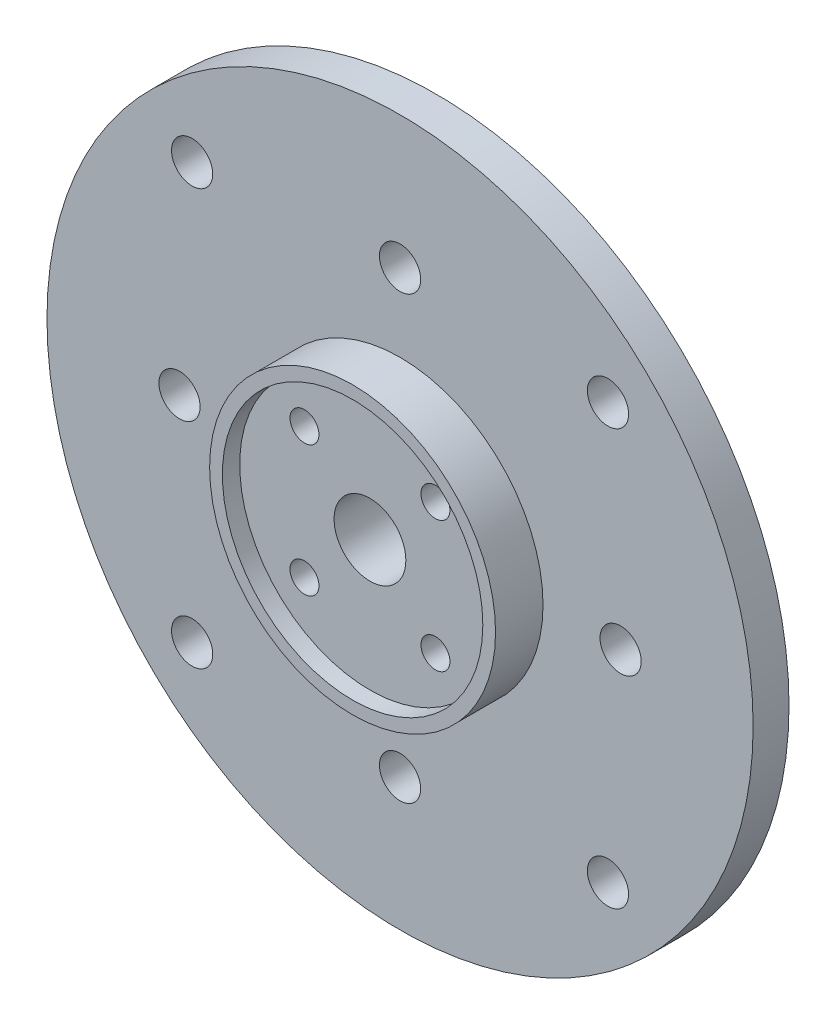
ISO-10303-21;
HEADER;
FILE_DESCRIPTION(('STEP AP214'),'2;1');
FILE_NAME('part.step','',(''),(''),'','','');
FILE_SCHEMA(('AUTOMOTIVE_DESIGN { 1 0 10303 214 1 1 1 1 }'));
ENDSEC;
DATA;
#1=APPLICATION_CONTEXT('core data for automotive mechanical design processes');
#2=APPLICATION_PROTOCOL_DEFINITION('international standard','automotive_design',2000,#1);
#3=PRODUCT_CONTEXT('',#1,'mechanical');
#4=PRODUCT('Part','Part','',(#3));
#5=PRODUCT_RELATED_PRODUCT_CATEGORY('part','',(#4));
#6=PRODUCT_DEFINITION_FORMATION('','',#4);
#7=PRODUCT_DEFINITION_CONTEXT('part definition',#1,'design');
#8=PRODUCT_DEFINITION('design','',#6,#7);
#9=PRODUCT_DEFINITION_SHAPE('','',#8);
#10=(LENGTH_UNIT() NAMED_UNIT(*) SI_UNIT(.MILLI.,.METRE.));
#11=(NAMED_UNIT(*) PLANE_ANGLE_UNIT() SI_UNIT($,.RADIAN.));
#12=(NAMED_UNIT(*) SI_UNIT($,.STERADIAN.) SOLID_ANGLE_UNIT());
#13=UNCERTAINTY_MEASURE_WITH_UNIT(LENGTH_MEASURE(1.E-05),#10,'distance_accuracy_value','');
#14=(GEOMETRIC_REPRESENTATION_CONTEXT(3) GLOBAL_UNCERTAINTY_ASSIGNED_CONTEXT((#13)) GLOBAL_UNIT_ASSIGNED_CONTEXT((#10,
#11,#12)) REPRESENTATION_CONTEXT('',''));
#15=CARTESIAN_POINT('',(0.,0.,0.));
#16=DIRECTION('',(0.,0.,1.));
#17=DIRECTION('',(1.,0.,0.));
#18=AXIS2_PLACEMENT_3D('',#15,#16,#17);
#19=CARTESIAN_POINT('',(0.,0.,3.1));
#20=DIRECTION('',(0.,0.,1.));
#21=DIRECTION('',(1.,0.,0.));
#22=AXIS2_PLACEMENT_3D('',#19,#20,#21);
#23=PLANE('',#22);
#24=CARTESIAN_POINT('',(0.,0.,3.1));
#25=DIRECTION('',(0.,0.,1.));
#26=DIRECTION('',(1.,0.,0.));
#27=AXIS2_PLACEMENT_3D('',#24,#25,#26);
#28=CIRCLE('',#27,12.35);
#29=CARTESIAN_POINT('',(12.35,0.,3.1));
#30=VERTEX_POINT('',#29);
#31=EDGE_CURVE('E95',#30,#30,#28,.T.);
#32=ORIENTED_EDGE('',*,*,#31,.F.);
#33=EDGE_LOOP('',(#32));
#34=FACE_BOUND('',#33,.T.);
#35=CARTESIAN_POINT('',(-17.9605122421372,-17.9605122421394,3.1));
#36=DIRECTION('',(0.,0.,1.));
#37=DIRECTION('',(1.,0.,0.));
#38=AXIS2_PLACEMENT_3D('',#35,#36,#37);
#39=CIRCLE('',#38,1.78);
#40=CARTESIAN_POINT('',(-16.1805122421372,-17.9605122421394,3.1));
#41=VERTEX_POINT('',#40);
#42=EDGE_CURVE('E80',#41,#41,#39,.T.);
#43=ORIENTED_EDGE('',*,*,#42,.F.);
#44=EDGE_LOOP('',(#43));
#45=FACE_BOUND('',#44,.T.);
#46=CARTESIAN_POINT('',(-19.0499999999997,-3.08829826705805E-13,3.1));
#47=DIRECTION('',(0.,0.,1.));
#48=DIRECTION('',(1.,0.,0.));
#49=AXIS2_PLACEMENT_3D('',#46,#47,#48);
#50=CIRCLE('',#49,1.78);
#51=CARTESIAN_POINT('',(-17.2699999999997,-3.08829826705805E-13,3.1));
#52=VERTEX_POINT('',#51);
#53=EDGE_CURVE('E68',#52,#52,#50,.T.);
#54=ORIENTED_EDGE('',*,*,#53,.F.);
#55=EDGE_LOOP('',(#54));
#56=FACE_BOUND('',#55,.T.);
#57=CARTESIAN_POINT('',(19.0500000000003,3.06496874553429E-13,3.1));
#58=DIRECTION('',(0.,0.,1.));
#59=DIRECTION('',(1.,0.,0.));
#60=AXIS2_PLACEMENT_3D('',#57,#58,#59);
#61=CIRCLE('',#60,1.78);
#62=CARTESIAN_POINT('',(20.8300000000003,3.06496874553429E-13,3.1));
#63=VERTEX_POINT('',#62);
#64=EDGE_CURVE('E56',#63,#63,#61,.T.);
#65=ORIENTED_EDGE('',*,*,#64,.F.);
#66=EDGE_LOOP('',(#65));
#67=FACE_BOUND('',#66,.T.);
#68=CARTESIAN_POINT('',(0.,19.05,3.1));
#69=DIRECTION('',(0.,0.,1.));
#70=DIRECTION('',(1.,0.,0.));
#71=AXIS2_PLACEMENT_3D('',#68,#69,#70);
#72=CIRCLE('',#71,1.78);
#73=CARTESIAN_POINT('',(1.78,19.05,3.1));
#74=VERTEX_POINT('',#73);
#75=EDGE_CURVE('E45',#74,#74,#72,.T.);
#76=ORIENTED_EDGE('',*,*,#75,.F.);
#77=EDGE_LOOP('',(#76));
#78=FACE_BOUND('',#77,.T.);
#79=CARTESIAN_POINT('',(0.,0.,3.1));
#80=DIRECTION('',(0.,0.,1.));
#81=DIRECTION('',(1.,0.,0.));
#82=AXIS2_PLACEMENT_3D('',#79,#80,#81);
#83=CIRCLE('',#82,30.5);
#84=CARTESIAN_POINT('',(30.5,0.,3.1));
#85=VERTEX_POINT('',#84);
#86=EDGE_CURVE('E10',#85,#85,#83,.T.);
#87=ORIENTED_EDGE('',*,*,#86,.T.);
#88=EDGE_LOOP('',(#87));
#89=FACE_BOUND('',#88,.T.);
#90=CARTESIAN_POINT('',(17.9605122421382,17.9605122421384,3.1));
#91=DIRECTION('',(0.,0.,1.));
#92=DIRECTION('',(1.,0.,0.));
#93=AXIS2_PLACEMENT_3D('',#90,#91,#92);
#94=CIRCLE('',#93,1.78);
#95=CARTESIAN_POINT('',(19.7405122421382,17.9605122421384,3.1));
#96=VERTEX_POINT('',#95);
#97=EDGE_CURVE('E50',#96,#96,#94,.T.);
#98=ORIENTED_EDGE('',*,*,#97,.F.);
#99=EDGE_LOOP('',(#98));
#100=FACE_BOUND('',#99,.T.);
#101=CARTESIAN_POINT('',(6.12611479067258E-13,-19.05,3.1));
#102=DIRECTION('',(0.,0.,1.));
#103=DIRECTION('',(1.,0.,0.));
#104=AXIS2_PLACEMENT_3D('',#101,#102,#103);
#105=CIRCLE('',#104,1.78);
#106=CARTESIAN_POINT('',(1.78000000000061,-19.05,3.1));
#107=VERTEX_POINT('',#106);
#108=EDGE_CURVE('E62',#107,#107,#105,.T.);
#109=ORIENTED_EDGE('',*,*,#108,.F.);
#110=EDGE_LOOP('',(#109));
#111=FACE_BOUND('',#110,.T.);
#112=CARTESIAN_POINT('',(17.9605122421394,-17.9605122421382,3.1));
#113=DIRECTION('',(0.,0.,1.));
#114=DIRECTION('',(1.,0.,0.));
#115=AXIS2_PLACEMENT_3D('',#112,#113,#114);
#116=CIRCLE('',#115,1.78);
#117=CARTESIAN_POINT('',(19.7405122421394,-17.9605122421382,3.1));
#118=VERTEX_POINT('',#117);
#119=EDGE_CURVE('E74',#118,#118,#116,.T.);
#120=ORIENTED_EDGE('',*,*,#119,.F.);
#121=EDGE_LOOP('',(#120));
#122=FACE_BOUND('',#121,.T.);
#123=CARTESIAN_POINT('',(-17.9605122421384,17.9605122421372,3.1));
#124=DIRECTION('',(0.,0.,1.));
#125=DIRECTION('',(1.,0.,0.));
#126=AXIS2_PLACEMENT_3D('',#123,#124,#125);
#127=CIRCLE('',#126,1.78);
#128=CARTESIAN_POINT('',(-16.1805122421384,17.9605122421372,3.1));
#129=VERTEX_POINT('',#128);
#130=EDGE_CURVE('E86',#129,#129,#127,.T.);
#131=ORIENTED_EDGE('',*,*,#130,.F.);
#132=EDGE_LOOP('',(#131));
#133=FACE_BOUND('',#132,.T.);
#134=ADVANCED_FACE('F34',(#34,#45,#56,#67,#78,#89,#100,#111,#122,#133),#23,.T.);
#135=CARTESIAN_POINT('',(0.,0.,0.));
#136=DIRECTION('',(0.,0.,1.));
#137=DIRECTION('',(1.,0.,0.));
#138=AXIS2_PLACEMENT_3D('',#135,#136,#137);
#139=PLANE('',#138);
#140=CARTESIAN_POINT('',(-5.65685424949242,5.6568542494918,0.));
#141=DIRECTION('',(0.,0.,1.));
#142=DIRECTION('',(1.,0.,0.));
#143=AXIS2_PLACEMENT_3D('',#140,#141,#142);
#144=CIRCLE('',#143,1.25);
#145=CARTESIAN_POINT('',(-4.40685424949241,5.6568542494918,0.));
#146=VERTEX_POINT('',#145);
#147=EDGE_CURVE('E113',#146,#146,#144,.T.);
#148=ORIENTED_EDGE('',*,*,#147,.T.);
#149=EDGE_LOOP('',(#148));
#150=FACE_BOUND('',#149,.T.);
#151=CARTESIAN_POINT('',(-5.6568542494918,-5.65685424949296,0.));
#152=DIRECTION('',(0.,0.,1.));
#153=DIRECTION('',(1.,0.,0.));
#154=AXIS2_PLACEMENT_3D('',#151,#152,#153);
#155=CIRCLE('',#154,1.25);
#156=CARTESIAN_POINT('',(-4.4068542494918,-5.65685424949296,0.));
#157=VERTEX_POINT('',#156);
#158=EDGE_CURVE('E119',#157,#157,#155,.T.);
#159=ORIENTED_EDGE('',*,*,#158,.T.);
#160=EDGE_LOOP('',(#159));
#161=FACE_BOUND('',#160,.T.);
#162=CARTESIAN_POINT('',(5.65685424949296,-5.65685424949235,0.));
#163=DIRECTION('',(0.,0.,1.));
#164=DIRECTION('',(1.,0.,0.));
#165=AXIS2_PLACEMENT_3D('',#162,#163,#164);
#166=CIRCLE('',#165,1.25);
#167=CARTESIAN_POINT('',(6.90685424949296,-5.65685424949235,0.));
#168=VERTEX_POINT('',#167);
#169=EDGE_CURVE('E125',#168,#168,#166,.T.);
#170=ORIENTED_EDGE('',*,*,#169,.T.);
#171=EDGE_LOOP('',(#170));
#172=FACE_BOUND('',#171,.T.);
#173=CARTESIAN_POINT('',(0.,0.,0.));
#174=DIRECTION('',(0.,0.,1.));
#175=DIRECTION('',(1.,0.,0.));
#176=AXIS2_PLACEMENT_3D('',#173,#174,#175);
#177=CIRCLE('',#176,3.1);
#178=CARTESIAN_POINT('',(3.1,0.,0.));
#179=VERTEX_POINT('',#178);
#180=EDGE_CURVE('E131',#179,#179,#177,.T.);
#181=ORIENTED_EDGE('',*,*,#180,.T.);
#182=EDGE_LOOP('',(#181));
#183=FACE_BOUND('',#182,.T.);
#184=CARTESIAN_POINT('',(5.65685424949235,5.65685424949241,0.));
#185=DIRECTION('',(0.,0.,1.));
#186=DIRECTION('',(1.,0.,0.));
#187=AXIS2_PLACEMENT_3D('',#184,#185,#186);
#188=CIRCLE('',#187,1.25);
#189=CARTESIAN_POINT('',(6.90685424949235,5.65685424949241,0.));
#190=VERTEX_POINT('',#189);
#191=EDGE_CURVE('E104',#190,#190,#188,.T.);
#192=ORIENTED_EDGE('',*,*,#191,.T.);
#193=EDGE_LOOP('',(#192));
#194=FACE_BOUND('',#193,.T.);
#195=CARTESIAN_POINT('',(0.,0.,0.));
#196=DIRECTION('',(0.,0.,1.));
#197=DIRECTION('',(1.,0.,0.));
#198=AXIS2_PLACEMENT_3D('',#195,#196,#197);
#199=CIRCLE('',#198,30.5);
#200=CARTESIAN_POINT('',(30.5,0.,0.));
#201=VERTEX_POINT('',#200);
#202=EDGE_CURVE('E38',#201,#201,#199,.T.);
#203=ORIENTED_EDGE('',*,*,#202,.F.);
#204=EDGE_LOOP('',(#203));
#205=FACE_BOUND('',#204,.T.);
#206=CARTESIAN_POINT('',(0.,19.05,0.));
#207=DIRECTION('',(0.,0.,1.));
#208=DIRECTION('',(1.,0.,0.));
#209=AXIS2_PLACEMENT_3D('',#206,#207,#208);
#210=CIRCLE('',#209,1.78);
#211=CARTESIAN_POINT('',(1.78,19.05,0.));
#212=VERTEX_POINT('',#211);
#213=EDGE_CURVE('E47',#212,#212,#210,.T.);
#214=ORIENTED_EDGE('',*,*,#213,.T.);
#215=EDGE_LOOP('',(#214));
#216=FACE_BOUND('',#215,.T.);
#217=CARTESIAN_POINT('',(17.9605122421382,17.9605122421384,0.));
#218=DIRECTION('',(0.,0.,1.));
#219=DIRECTION('',(1.,0.,0.));
#220=AXIS2_PLACEMENT_3D('',#217,#218,#219);
#221=CIRCLE('',#220,1.78);
#222=CARTESIAN_POINT('',(19.7405122421382,17.9605122421384,0.));
#223=VERTEX_POINT('',#222);
#224=EDGE_CURVE('E53',#223,#223,#221,.T.);
#225=ORIENTED_EDGE('',*,*,#224,.T.);
#226=EDGE_LOOP('',(#225));
#227=FACE_BOUND('',#226,.T.);
#228=CARTESIAN_POINT('',(19.0500000000003,3.06496874553429E-13,0.));
#229=DIRECTION('',(0.,0.,1.));
#230=DIRECTION('',(1.,0.,0.));
#231=AXIS2_PLACEMENT_3D('',#228,#229,#230);
#232=CIRCLE('',#231,1.78);
#233=CARTESIAN_POINT('',(20.8300000000003,3.06496874553429E-13,0.));
#234=VERTEX_POINT('',#233);
#235=EDGE_CURVE('E59',#234,#234,#232,.T.);
#236=ORIENTED_EDGE('',*,*,#235,.T.);
#237=EDGE_LOOP('',(#236));
#238=FACE_BOUND('',#237,.T.);
#239=CARTESIAN_POINT('',(6.12611479067258E-13,-19.05,0.));
#240=DIRECTION('',(0.,0.,1.));
#241=DIRECTION('',(1.,0.,0.));
#242=AXIS2_PLACEMENT_3D('',#239,#240,#241);
#243=CIRCLE('',#242,1.78);
#244=CARTESIAN_POINT('',(1.78000000000061,-19.05,0.));
#245=VERTEX_POINT('',#244);
#246=EDGE_CURVE('E65',#245,#245,#243,.T.);
#247=ORIENTED_EDGE('',*,*,#246,.T.);
#248=EDGE_LOOP('',(#247));
#249=FACE_BOUND('',#248,.T.);
#250=CARTESIAN_POINT('',(-19.0499999999997,-3.08829826705805E-13,0.));
#251=DIRECTION('',(0.,0.,1.));
#252=DIRECTION('',(1.,0.,0.));
#253=AXIS2_PLACEMENT_3D('',#250,#251,#252);
#254=CIRCLE('',#253,1.78);
#255=CARTESIAN_POINT('',(-17.2699999999997,-3.08829826705805E-13,0.));
#256=VERTEX_POINT('',#255);
#257=EDGE_CURVE('E71',#256,#256,#254,.T.);
#258=ORIENTED_EDGE('',*,*,#257,.T.);
#259=EDGE_LOOP('',(#258));
#260=FACE_BOUND('',#259,.T.);
#261=CARTESIAN_POINT('',(17.9605122421394,-17.9605122421382,0.));
#262=DIRECTION('',(0.,0.,1.));
#263=DIRECTION('',(1.,0.,0.));
#264=AXIS2_PLACEMENT_3D('',#261,#262,#263);
#265=CIRCLE('',#264,1.78);
#266=CARTESIAN_POINT('',(19.7405122421394,-17.9605122421382,0.));
#267=VERTEX_POINT('',#266);
#268=EDGE_CURVE('E77',#267,#267,#265,.T.);
#269=ORIENTED_EDGE('',*,*,#268,.T.);
#270=EDGE_LOOP('',(#269));
#271=FACE_BOUND('',#270,.T.);
#272=CARTESIAN_POINT('',(-17.9605122421372,-17.9605122421394,0.));
#273=DIRECTION('',(0.,0.,1.));
#274=DIRECTION('',(1.,0.,0.));
#275=AXIS2_PLACEMENT_3D('',#272,#273,#274);
#276=CIRCLE('',#275,1.78);
#277=CARTESIAN_POINT('',(-16.1805122421372,-17.9605122421394,0.));
#278=VERTEX_POINT('',#277);
#279=EDGE_CURVE('E83',#278,#278,#276,.T.);
#280=ORIENTED_EDGE('',*,*,#279,.T.);
#281=EDGE_LOOP('',(#280));
#282=FACE_BOUND('',#281,.T.);
#283=CARTESIAN_POINT('',(-17.9605122421384,17.9605122421372,0.));
#284=DIRECTION('',(0.,0.,1.));
#285=DIRECTION('',(1.,0.,0.));
#286=AXIS2_PLACEMENT_3D('',#283,#284,#285);
#287=CIRCLE('',#286,1.78);
#288=CARTESIAN_POINT('',(-16.1805122421384,17.9605122421372,0.));
#289=VERTEX_POINT('',#288);
#290=EDGE_CURVE('E89',#289,#289,#287,.T.);
#291=ORIENTED_EDGE('',*,*,#290,.T.);
#292=EDGE_LOOP('',(#291));
#293=FACE_BOUND('',#292,.T.);
#294=ADVANCED_FACE('F175',(#150,#161,#172,#183,#194,#205,#216,#227,#238,#249,#260,#271,#282,
#293),#139,.F.);
#295=CARTESIAN_POINT('',(0.,0.,3.1));
#296=DIRECTION('',(0.,0.,-1.));
#297=DIRECTION('',(-1.,0.,0.));
#298=AXIS2_PLACEMENT_3D('',#295,#296,#297);
#299=CYLINDRICAL_SURFACE('',#298,30.5);
#300=ORIENTED_EDGE('',*,*,#86,.F.);
#301=EDGE_LOOP('',(#300));
#302=FACE_BOUND('',#301,.T.);
#303=ORIENTED_EDGE('',*,*,#202,.T.);
#304=EDGE_LOOP('',(#303));
#305=FACE_BOUND('',#304,.T.);
#306=ADVANCED_FACE('F36',(#302,#305),#299,.T.);
#307=CARTESIAN_POINT('',(0.,19.05,3.1));
#308=DIRECTION('',(0.,0.,-1.));
#309=DIRECTION('',(-1.,0.,0.));
#310=AXIS2_PLACEMENT_3D('',#307,#308,#309);
#311=CYLINDRICAL_SURFACE('',#310,1.78);
#312=ORIENTED_EDGE('',*,*,#75,.T.);
#313=EDGE_LOOP('',(#312));
#314=FACE_BOUND('',#313,.T.);
#315=ORIENTED_EDGE('',*,*,#213,.F.);
#316=EDGE_LOOP('',(#315));
#317=FACE_BOUND('',#316,.T.);
#318=ADVANCED_FACE('F204',(#314,#317),#311,.F.);
#319=CARTESIAN_POINT('',(17.9605122421382,17.9605122421384,3.1));
#320=DIRECTION('',(0.,0.,-1.));
#321=DIRECTION('',(-1.,0.,0.));
#322=AXIS2_PLACEMENT_3D('',#319,#320,#321);
#323=CYLINDRICAL_SURFACE('',#322,1.78);
#324=ORIENTED_EDGE('',*,*,#97,.T.);
#325=EDGE_LOOP('',(#324));
#326=FACE_BOUND('',#325,.T.);
#327=ORIENTED_EDGE('',*,*,#224,.F.);
#328=EDGE_LOOP('',(#327));
#329=FACE_BOUND('',#328,.T.);
#330=ADVANCED_FACE('F210',(#326,#329),#323,.F.);
#331=CARTESIAN_POINT('',(19.0500000000003,3.06496874553429E-13,3.1));
#332=DIRECTION('',(0.,0.,-1.));
#333=DIRECTION('',(-1.,0.,0.));
#334=AXIS2_PLACEMENT_3D('',#331,#332,#333);
#335=CYLINDRICAL_SURFACE('',#334,1.78);
#336=ORIENTED_EDGE('',*,*,#64,.T.);
#337=EDGE_LOOP('',(#336));
#338=FACE_BOUND('',#337,.T.);
#339=ORIENTED_EDGE('',*,*,#235,.F.);
#340=EDGE_LOOP('',(#339));
#341=FACE_BOUND('',#340,.T.);
#342=ADVANCED_FACE('F214',(#338,#341),#335,.F.);
#343=CARTESIAN_POINT('',(6.12611479067258E-13,-19.05,3.1));
#344=DIRECTION('',(0.,0.,-1.));
#345=DIRECTION('',(-1.,0.,0.));
#346=AXIS2_PLACEMENT_3D('',#343,#344,#345);
#347=CYLINDRICAL_SURFACE('',#346,1.78);
#348=ORIENTED_EDGE('',*,*,#108,.T.);
#349=EDGE_LOOP('',(#348));
#350=FACE_BOUND('',#349,.T.);
#351=ORIENTED_EDGE('',*,*,#246,.F.);
#352=EDGE_LOOP('',(#351));
#353=FACE_BOUND('',#352,.T.);
#354=ADVANCED_FACE('F218',(#350,#353),#347,.F.);
#355=CARTESIAN_POINT('',(-19.0499999999997,-3.08829826705805E-13,3.1));
#356=DIRECTION('',(0.,0.,-1.));
#357=DIRECTION('',(-1.,0.,0.));
#358=AXIS2_PLACEMENT_3D('',#355,#356,#357);
#359=CYLINDRICAL_SURFACE('',#358,1.78);
#360=ORIENTED_EDGE('',*,*,#53,.T.);
#361=EDGE_LOOP('',(#360));
#362=FACE_BOUND('',#361,.T.);
#363=ORIENTED_EDGE('',*,*,#257,.F.);
#364=EDGE_LOOP('',(#363));
#365=FACE_BOUND('',#364,.T.);
#366=ADVANCED_FACE('F222',(#362,#365),#359,.F.);
#367=CARTESIAN_POINT('',(17.9605122421394,-17.9605122421382,3.1));
#368=DIRECTION('',(0.,0.,-1.));
#369=DIRECTION('',(-1.,0.,0.));
#370=AXIS2_PLACEMENT_3D('',#367,#368,#369);
#371=CYLINDRICAL_SURFACE('',#370,1.78);
#372=ORIENTED_EDGE('',*,*,#119,.T.);
#373=EDGE_LOOP('',(#372));
#374=FACE_BOUND('',#373,.T.);
#375=ORIENTED_EDGE('',*,*,#268,.F.);
#376=EDGE_LOOP('',(#375));
#377=FACE_BOUND('',#376,.T.);
#378=ADVANCED_FACE('F226',(#374,#377),#371,.F.);
#379=CARTESIAN_POINT('',(-17.9605122421372,-17.9605122421394,3.1));
#380=DIRECTION('',(0.,0.,-1.));
#381=DIRECTION('',(-1.,0.,0.));
#382=AXIS2_PLACEMENT_3D('',#379,#380,#381);
#383=CYLINDRICAL_SURFACE('',#382,1.78);
#384=ORIENTED_EDGE('',*,*,#42,.T.);
#385=EDGE_LOOP('',(#384));
#386=FACE_BOUND('',#385,.T.);
#387=ORIENTED_EDGE('',*,*,#279,.F.);
#388=EDGE_LOOP('',(#387));
#389=FACE_BOUND('',#388,.T.);
#390=ADVANCED_FACE('F195',(#386,#389),#383,.F.);
#391=CARTESIAN_POINT('',(-17.9605122421384,17.9605122421372,3.1));
#392=DIRECTION('',(0.,0.,-1.));
#393=DIRECTION('',(-1.,0.,0.));
#394=AXIS2_PLACEMENT_3D('',#391,#392,#393);
#395=CYLINDRICAL_SURFACE('',#394,1.78);
#396=ORIENTED_EDGE('',*,*,#130,.T.);
#397=EDGE_LOOP('',(#396));
#398=FACE_BOUND('',#397,.T.);
#399=ORIENTED_EDGE('',*,*,#290,.F.);
#400=EDGE_LOOP('',(#399));
#401=FACE_BOUND('',#400,.T.);
#402=ADVANCED_FACE('F169',(#398,#401),#395,.F.);
#403=CARTESIAN_POINT('',(0.,0.,7.2));
#404=DIRECTION('',(0.,0.,-1.));
#405=DIRECTION('',(-1.,0.,0.));
#406=AXIS2_PLACEMENT_3D('',#403,#404,#405);
#407=CYLINDRICAL_SURFACE('',#406,12.35);
#408=CARTESIAN_POINT('',(0.,0.,7.2));
#409=DIRECTION('',(0.,0.,1.));
#410=DIRECTION('',(1.,0.,0.));
#411=AXIS2_PLACEMENT_3D('',#408,#409,#410);
#412=CIRCLE('',#411,12.35);
#413=CARTESIAN_POINT('',(12.35,0.,7.2));
#414=VERTEX_POINT('',#413);
#415=EDGE_CURVE('E92',#414,#414,#412,.T.);
#416=ORIENTED_EDGE('',*,*,#415,.F.);
#417=EDGE_LOOP('',(#416));
#418=FACE_BOUND('',#417,.T.);
#419=ORIENTED_EDGE('',*,*,#31,.T.);
#420=EDGE_LOOP('',(#419));
#421=FACE_BOUND('',#420,.T.);
#422=ADVANCED_FACE('F163',(#418,#421),#407,.T.);
#423=CARTESIAN_POINT('',(0.,0.,7.2));
#424=DIRECTION('',(0.,0.,1.));
#425=DIRECTION('',(1.,0.,0.));
#426=AXIS2_PLACEMENT_3D('',#423,#424,#425);
#427=PLANE('',#426);
#428=CARTESIAN_POINT('',(0.,0.,7.2));
#429=DIRECTION('',(0.,0.,1.));
#430=DIRECTION('',(1.,0.,0.));
#431=AXIS2_PLACEMENT_3D('',#428,#429,#430);
#432=CIRCLE('',#431,11.25);
#433=CARTESIAN_POINT('',(11.25,0.,7.2));
#434=VERTEX_POINT('',#433);
#435=EDGE_CURVE('E101',#434,#434,#432,.T.);
#436=ORIENTED_EDGE('',*,*,#435,.F.);
#437=EDGE_LOOP('',(#436));
#438=FACE_BOUND('',#437,.T.);
#439=ORIENTED_EDGE('',*,*,#415,.T.);
#440=EDGE_LOOP('',(#439));
#441=FACE_BOUND('',#440,.T.);
#442=ADVANCED_FACE('F157',(#438,#441),#427,.T.);
#443=CARTESIAN_POINT('',(0.,0.,5.7));
#444=DIRECTION('',(0.,0.,1.));
#445=DIRECTION('',(1.,0.,0.));
#446=AXIS2_PLACEMENT_3D('',#443,#444,#445);
#447=CYLINDRICAL_SURFACE('',#446,11.25);
#448=CARTESIAN_POINT('',(0.,0.,5.7));
#449=DIRECTION('',(0.,0.,1.));
#450=DIRECTION('',(1.,0.,0.));
#451=AXIS2_PLACEMENT_3D('',#448,#449,#450);
#452=CIRCLE('',#451,11.25);
#453=CARTESIAN_POINT('',(11.25,0.,5.7));
#454=VERTEX_POINT('',#453);
#455=EDGE_CURVE('E98',#454,#454,#452,.T.);
#456=ORIENTED_EDGE('',*,*,#455,.F.);
#457=EDGE_LOOP('',(#456));
#458=FACE_BOUND('',#457,.T.);
#459=ORIENTED_EDGE('',*,*,#435,.T.);
#460=EDGE_LOOP('',(#459));
#461=FACE_BOUND('',#460,.T.);
#462=ADVANCED_FACE('F143',(#458,#461),#447,.F.);
#463=CARTESIAN_POINT('',(0.,0.,5.7));
#464=DIRECTION('',(0.,0.,1.));
#465=DIRECTION('',(1.,0.,0.));
#466=AXIS2_PLACEMENT_3D('',#463,#464,#465);
#467=PLANE('',#466);
#468=CARTESIAN_POINT('',(0.,0.,5.7));
#469=DIRECTION('',(0.,0.,1.));
#470=DIRECTION('',(1.,0.,0.));
#471=AXIS2_PLACEMENT_3D('',#468,#469,#470);
#472=CIRCLE('',#471,3.1);
#473=CARTESIAN_POINT('',(3.1,0.,5.7));
#474=VERTEX_POINT('',#473);
#475=EDGE_CURVE('E110',#474,#474,#472,.T.);
#476=ORIENTED_EDGE('',*,*,#475,.F.);
#477=EDGE_LOOP('',(#476));
#478=FACE_BOUND('',#477,.T.);
#479=CARTESIAN_POINT('',(-5.65685424949242,5.6568542494918,5.7));
#480=DIRECTION('',(0.,0.,1.));
#481=DIRECTION('',(1.,0.,0.));
#482=AXIS2_PLACEMENT_3D('',#479,#480,#481);
#483=CIRCLE('',#482,1.25);
#484=CARTESIAN_POINT('',(-4.40685424949241,5.6568542494918,5.7));
#485=VERTEX_POINT('',#484);
#486=EDGE_CURVE('E116',#485,#485,#483,.T.);
#487=ORIENTED_EDGE('',*,*,#486,.F.);
#488=EDGE_LOOP('',(#487));
#489=FACE_BOUND('',#488,.T.);
#490=CARTESIAN_POINT('',(-5.6568542494918,-5.65685424949296,5.7));
#491=DIRECTION('',(0.,0.,1.));
#492=DIRECTION('',(1.,0.,0.));
#493=AXIS2_PLACEMENT_3D('',#490,#491,#492);
#494=CIRCLE('',#493,1.25);
#495=CARTESIAN_POINT('',(-4.4068542494918,-5.65685424949296,5.7));
#496=VERTEX_POINT('',#495);
#497=EDGE_CURVE('E122',#496,#496,#494,.T.);
#498=ORIENTED_EDGE('',*,*,#497,.F.);
#499=EDGE_LOOP('',(#498));
#500=FACE_BOUND('',#499,.T.);
#501=CARTESIAN_POINT('',(5.65685424949296,-5.65685424949235,5.7));
#502=DIRECTION('',(0.,0.,1.));
#503=DIRECTION('',(1.,0.,0.));
#504=AXIS2_PLACEMENT_3D('',#501,#502,#503);
#505=CIRCLE('',#504,1.25);
#506=CARTESIAN_POINT('',(6.90685424949296,-5.65685424949235,5.7));
#507=VERTEX_POINT('',#506);
#508=EDGE_CURVE('E128',#507,#507,#505,.T.);
#509=ORIENTED_EDGE('',*,*,#508,.F.);
#510=EDGE_LOOP('',(#509));
#511=FACE_BOUND('',#510,.T.);
#512=CARTESIAN_POINT('',(5.65685424949235,5.65685424949241,5.7));
#513=DIRECTION('',(0.,0.,1.));
#514=DIRECTION('',(1.,0.,0.));
#515=AXIS2_PLACEMENT_3D('',#512,#513,#514);
#516=CIRCLE('',#515,1.25);
#517=CARTESIAN_POINT('',(6.90685424949235,5.65685424949241,5.7));
#518=VERTEX_POINT('',#517);
#519=EDGE_CURVE('E107',#518,#518,#516,.T.);
#520=ORIENTED_EDGE('',*,*,#519,.F.);
#521=EDGE_LOOP('',(#520));
#522=FACE_BOUND('',#521,.T.);
#523=ORIENTED_EDGE('',*,*,#455,.T.);
#524=EDGE_LOOP('',(#523));
#525=FACE_BOUND('',#524,.T.);
#526=ADVANCED_FACE('F139',(#478,#489,#500,#511,#522,#525),#467,.T.);
#527=CARTESIAN_POINT('',(5.65685424949235,5.65685424949241,0.));
#528=DIRECTION('',(0.,0.,1.));
#529=DIRECTION('',(1.,0.,0.));
#530=AXIS2_PLACEMENT_3D('',#527,#528,#529);
#531=CYLINDRICAL_SURFACE('',#530,1.25);
#532=ORIENTED_EDGE('',*,*,#191,.F.);
#533=EDGE_LOOP('',(#532));
#534=FACE_BOUND('',#533,.T.);
#535=ORIENTED_EDGE('',*,*,#519,.T.);
#536=EDGE_LOOP('',(#535));
#537=FACE_BOUND('',#536,.T.);
#538=ADVANCED_FACE('F142',(#534,#537),#531,.F.);
#539=CARTESIAN_POINT('',(5.65685424949296,-5.65685424949235,0.));
#540=DIRECTION('',(0.,0.,1.));
#541=DIRECTION('',(1.,0.,0.));
#542=AXIS2_PLACEMENT_3D('',#539,#540,#541);
#543=CYLINDRICAL_SURFACE('',#542,1.25);
#544=ORIENTED_EDGE('',*,*,#169,.F.);
#545=EDGE_LOOP('',(#544));
#546=FACE_BOUND('',#545,.T.);
#547=ORIENTED_EDGE('',*,*,#508,.T.);
#548=EDGE_LOOP('',(#547));
#549=FACE_BOUND('',#548,.T.);
#550=ADVANCED_FACE('F236',(#546,#549),#543,.F.);
#551=CARTESIAN_POINT('',(-5.6568542494918,-5.65685424949296,0.));
#552=DIRECTION('',(0.,0.,1.));
#553=DIRECTION('',(1.,0.,0.));
#554=AXIS2_PLACEMENT_3D('',#551,#552,#553);
#555=CYLINDRICAL_SURFACE('',#554,1.25);
#556=ORIENTED_EDGE('',*,*,#158,.F.);
#557=EDGE_LOOP('',(#556));
#558=FACE_BOUND('',#557,.T.);
#559=ORIENTED_EDGE('',*,*,#497,.T.);
#560=EDGE_LOOP('',(#559));
#561=FACE_BOUND('',#560,.T.);
#562=ADVANCED_FACE('F241',(#558,#561),#555,.F.);
#563=CARTESIAN_POINT('',(-5.65685424949242,5.6568542494918,0.));
#564=DIRECTION('',(0.,0.,1.));
#565=DIRECTION('',(1.,0.,0.));
#566=AXIS2_PLACEMENT_3D('',#563,#564,#565);
#567=CYLINDRICAL_SURFACE('',#566,1.25);
#568=ORIENTED_EDGE('',*,*,#147,.F.);
#569=EDGE_LOOP('',(#568));
#570=FACE_BOUND('',#569,.T.);
#571=ORIENTED_EDGE('',*,*,#486,.T.);
#572=EDGE_LOOP('',(#571));
#573=FACE_BOUND('',#572,.T.);
#574=ADVANCED_FACE('F238',(#570,#573),#567,.F.);
#575=CARTESIAN_POINT('',(0.,0.,0.));
#576=DIRECTION('',(0.,0.,1.));
#577=DIRECTION('',(1.,0.,0.));
#578=AXIS2_PLACEMENT_3D('',#575,#576,#577);
#579=CYLINDRICAL_SURFACE('',#578,3.1);
#580=ORIENTED_EDGE('',*,*,#180,.F.);
#581=EDGE_LOOP('',(#580));
#582=FACE_BOUND('',#581,.T.);
#583=ORIENTED_EDGE('',*,*,#475,.T.);
#584=EDGE_LOOP('',(#583));
#585=FACE_BOUND('',#584,.T.);
#586=ADVANCED_FACE('F137',(#582,#585),#579,.F.);
#587=CLOSED_SHELL('',(#134,#294,#306,#318,#330,#342,#354,#366,#378,#390,#402,#422,#442,#462,
#526,#538,#550,#562,#574,#586));
#588=MANIFOLD_SOLID_BREP('B2',#587);
#589=ADVANCED_BREP_SHAPE_REPRESENTATION('',(#18,#588),#14);
#590=SHAPE_DEFINITION_REPRESENTATION(#9,#589);
ENDSEC;
END-ISO-10303-21;
